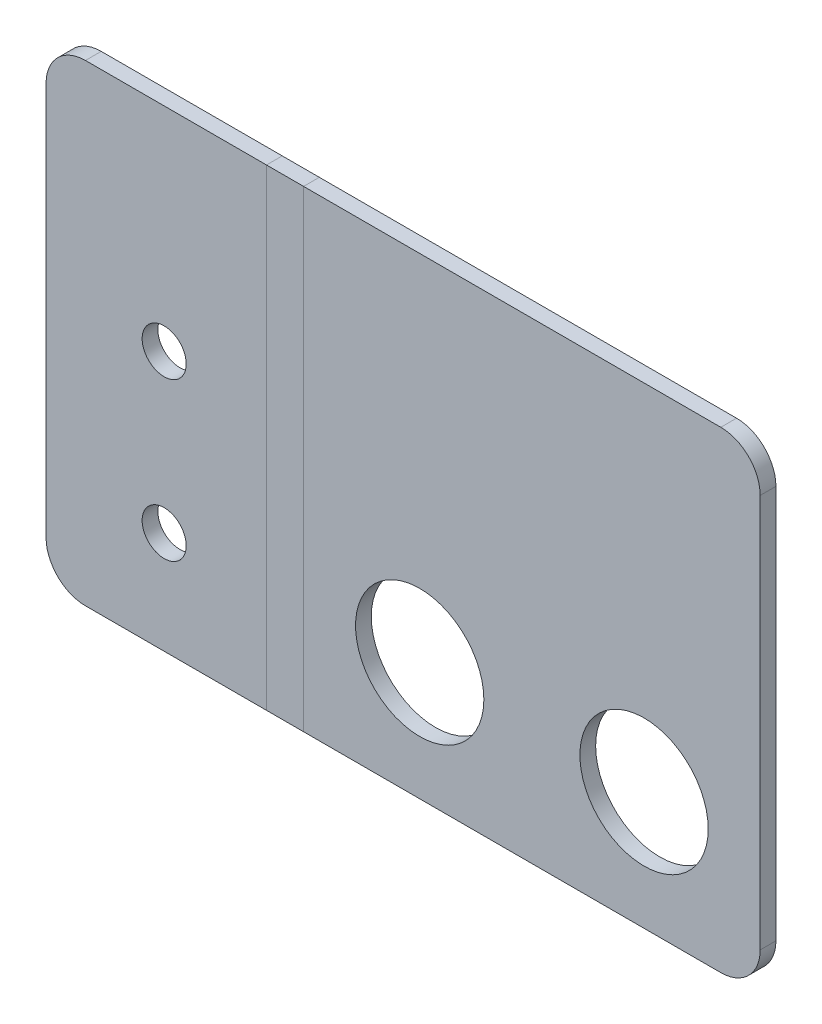
ISO-10303-21;
HEADER;
FILE_DESCRIPTION(('STEP AP214'),'2;1');
FILE_NAME('part.step','',(''),(''),'','','');
FILE_SCHEMA(('AUTOMOTIVE_DESIGN { 1 0 10303 214 1 1 1 1 }'));
ENDSEC;
DATA;
#1=APPLICATION_CONTEXT('core data for automotive mechanical design processes');
#2=APPLICATION_PROTOCOL_DEFINITION('international standard','automotive_design',2000,#1);
#3=PRODUCT_CONTEXT('',#1,'mechanical');
#4=PRODUCT('Part','Part','',(#3));
#5=PRODUCT_RELATED_PRODUCT_CATEGORY('part','',(#4));
#6=PRODUCT_DEFINITION_FORMATION('','',#4);
#7=PRODUCT_DEFINITION_CONTEXT('part definition',#1,'design');
#8=PRODUCT_DEFINITION('design','',#6,#7);
#9=PRODUCT_DEFINITION_SHAPE('','',#8);
#10=(LENGTH_UNIT() NAMED_UNIT(*) SI_UNIT(.MILLI.,.METRE.));
#11=(NAMED_UNIT(*) PLANE_ANGLE_UNIT() SI_UNIT($,.RADIAN.));
#12=(NAMED_UNIT(*) SI_UNIT($,.STERADIAN.) SOLID_ANGLE_UNIT());
#13=UNCERTAINTY_MEASURE_WITH_UNIT(LENGTH_MEASURE(1.E-05),#10,'distance_accuracy_value','');
#14=(GEOMETRIC_REPRESENTATION_CONTEXT(3) GLOBAL_UNCERTAINTY_ASSIGNED_CONTEXT((#13)) GLOBAL_UNIT_ASSIGNED_CONTEXT((#10,
#11,#12)) REPRESENTATION_CONTEXT('',''));
#15=CARTESIAN_POINT('',(0.,0.,0.));
#16=DIRECTION('',(0.,0.,1.));
#17=DIRECTION('',(1.,0.,0.));
#18=AXIS2_PLACEMENT_3D('',#15,#16,#17);
#19=CARTESIAN_POINT('',(75.7123889803847,-30.,2.00000000000041));
#20=DIRECTION('',(0.,1.,0.));
#21=DIRECTION('',(-1.,0.,0.));
#22=AXIS2_PLACEMENT_3D('',#19,#20,#21);
#23=PLANE('',#22);
#24=DIRECTION('',(1.,0.,0.));
#25=VECTOR('',#24,1.);
#26=CARTESIAN_POINT('',(75.7123889803847,-30.,4.0766001685455E-13));
#27=LINE('',#26,#25);
#28=CARTESIAN_POINT('',(17.7123889803847,-30.,0.));
#29=VERTEX_POINT('',#28);
#30=CARTESIAN_POINT('',(70.7123889803847,-30.,3.72965547335014E-13));
#31=VERTEX_POINT('',#30);
#32=EDGE_CURVE('E56',#29,#31,#27,.T.);
#33=ORIENTED_EDGE('',*,*,#32,.T.);
#34=DIRECTION('',(0.,0.,-1.));
#35=VECTOR('',#34,1.);
#36=CARTESIAN_POINT('',(70.7123889803847,-30.,2.00000000000037));
#37=LINE('',#36,#35);
#38=CARTESIAN_POINT('',(70.7123889803847,-30.,2.00000000000037));
#39=VERTEX_POINT('',#38);
#40=EDGE_CURVE('E252',#31,#39,#37,.F.);
#41=ORIENTED_EDGE('',*,*,#40,.T.);
#42=DIRECTION('',(1.,0.,0.));
#43=VECTOR('',#42,1.);
#44=CARTESIAN_POINT('',(75.7123889803847,-30.,2.00000000000041));
#45=LINE('',#44,#43);
#46=CARTESIAN_POINT('',(17.7123889803847,-30.,2.));
#47=VERTEX_POINT('',#46);
#48=EDGE_CURVE('E224',#47,#39,#45,.T.);
#49=ORIENTED_EDGE('',*,*,#48,.F.);
#50=DIRECTION('',(0.,0.,1.));
#51=VECTOR('',#50,1.);
#52=CARTESIAN_POINT('',(17.7123889803847,-30.,0.));
#53=LINE('',#52,#51);
#54=EDGE_CURVE('E11',#29,#47,#53,.T.);
#55=ORIENTED_EDGE('',*,*,#54,.F.);
#56=EDGE_LOOP('',(#33,#41,#49,#55));
#57=FACE_BOUND('',#56,.T.);
#58=ADVANCED_FACE('F41',(#57),#23,.F.);
#59=CARTESIAN_POINT('',(15.7123889803847,30.,1.99999999999999));
#60=DIRECTION('',(0.,-1.,0.));
#61=DIRECTION('',(1.,0.,0.));
#62=AXIS2_PLACEMENT_3D('',#59,#60,#61);
#63=PLANE('',#62);
#64=DIRECTION('',(-1.,0.,0.));
#65=VECTOR('',#64,1.);
#66=CARTESIAN_POINT('',(15.7123889803847,30.,1.99999999999999));
#67=LINE('',#66,#65);
#68=CARTESIAN_POINT('',(70.7123889803847,30.,2.00000000000037));
#69=VERTEX_POINT('',#68);
#70=CARTESIAN_POINT('',(17.7123889803847,30.,2.));
#71=VERTEX_POINT('',#70);
#72=EDGE_CURVE('E230',#69,#71,#67,.T.);
#73=ORIENTED_EDGE('',*,*,#72,.F.);
#74=DIRECTION('',(0.,0.,-1.));
#75=VECTOR('',#74,1.);
#76=CARTESIAN_POINT('',(70.7123889803847,30.,2.00000000000037));
#77=LINE('',#76,#75);
#78=CARTESIAN_POINT('',(70.7123889803847,30.,3.72965547335014E-13));
#79=VERTEX_POINT('',#78);
#80=EDGE_CURVE('E258',#69,#79,#77,.T.);
#81=ORIENTED_EDGE('',*,*,#80,.T.);
#82=DIRECTION('',(-1.,0.,0.));
#83=VECTOR('',#82,1.);
#84=CARTESIAN_POINT('',(15.7123889803847,30.,0.));
#85=LINE('',#84,#83);
#86=CARTESIAN_POINT('',(17.7123889803847,30.,0.));
#87=VERTEX_POINT('',#86);
#88=EDGE_CURVE('E64',#79,#87,#85,.T.);
#89=ORIENTED_EDGE('',*,*,#88,.T.);
#90=DIRECTION('',(0.,0.,1.));
#91=VECTOR('',#90,1.);
#92=CARTESIAN_POINT('',(17.7123889803847,30.,0.));
#93=LINE('',#92,#91);
#94=EDGE_CURVE('E261',#87,#71,#93,.T.);
#95=ORIENTED_EDGE('',*,*,#94,.T.);
#96=EDGE_LOOP('',(#73,#81,#89,#95));
#97=FACE_BOUND('',#96,.T.);
#98=ADVANCED_FACE('F299',(#97),#63,.F.);
#99=CARTESIAN_POINT('',(15.7123889803847,0.,1.99999999999999));
#100=DIRECTION('',(0.,0.,-1.));
#101=DIRECTION('',(-1.,0.,0.));
#102=AXIS2_PLACEMENT_3D('',#99,#100,#101);
#103=PLANE('',#102);
#104=CARTESIAN_POINT('',(32.4623889803847,-15.,2.0000000000001));
#105=DIRECTION('',(0.,0.,1.));
#106=DIRECTION('',(1.,0.,0.));
#107=AXIS2_PLACEMENT_3D('',#104,#105,#106);
#108=CIRCLE('',#107,8.15);
#109=CARTESIAN_POINT('',(40.6123889803847,-15.,2.00000000000016));
#110=VERTEX_POINT('',#109);
#111=EDGE_CURVE('E218',#110,#110,#108,.T.);
#112=ORIENTED_EDGE('',*,*,#111,.F.);
#113=EDGE_LOOP('',(#112));
#114=FACE_BOUND('',#113,.T.);
#115=CARTESIAN_POINT('',(60.9623889803847,-15.,2.00000000000031));
#116=DIRECTION('',(0.,0.,1.));
#117=DIRECTION('',(1.,0.,0.));
#118=AXIS2_PLACEMENT_3D('',#115,#116,#117);
#119=CIRCLE('',#118,8.15);
#120=CARTESIAN_POINT('',(69.1123889803847,-15.,2.00000000000036));
#121=VERTEX_POINT('',#120);
#122=EDGE_CURVE('E182',#121,#121,#119,.T.);
#123=ORIENTED_EDGE('',*,*,#122,.F.);
#124=EDGE_LOOP('',(#123));
#125=FACE_BOUND('',#124,.T.);
#126=ORIENTED_EDGE('',*,*,#48,.T.);
#127=CARTESIAN_POINT('',(70.7123889803847,-25.,2.00000000000037));
#128=DIRECTION('',(0.,0.,-1.));
#129=DIRECTION('',(-1.,0.,0.));
#130=AXIS2_PLACEMENT_3D('',#127,#128,#129);
#131=CIRCLE('',#130,5.);
#132=CARTESIAN_POINT('',(75.7123889803847,-25.,2.00000000000041));
#133=VERTEX_POINT('',#132);
#134=EDGE_CURVE('E256',#39,#133,#131,.F.);
#135=ORIENTED_EDGE('',*,*,#134,.T.);
#136=DIRECTION('',(0.,1.,0.));
#137=VECTOR('',#136,1.);
#138=CARTESIAN_POINT('',(75.7123889803847,30.,2.00000000000041));
#139=LINE('',#138,#137);
#140=CARTESIAN_POINT('',(75.7123889803847,25.,2.00000000000041));
#141=VERTEX_POINT('',#140);
#142=EDGE_CURVE('E227',#133,#141,#139,.T.);
#143=ORIENTED_EDGE('',*,*,#142,.T.);
#144=CARTESIAN_POINT('',(70.7123889803847,25.,2.00000000000037));
#145=DIRECTION('',(0.,0.,-1.));
#146=DIRECTION('',(-1.,0.,0.));
#147=AXIS2_PLACEMENT_3D('',#144,#145,#146);
#148=CIRCLE('',#147,5.);
#149=EDGE_CURVE('E254',#141,#69,#148,.F.);
#150=ORIENTED_EDGE('',*,*,#149,.T.);
#151=ORIENTED_EDGE('',*,*,#72,.T.);
#152=DIRECTION('',(0.,1.,0.));
#153=VECTOR('',#152,1.);
#154=CARTESIAN_POINT('',(17.7123889803847,0.,2.));
#155=LINE('',#154,#153);
#156=EDGE_CURVE('E170',#47,#71,#155,.T.);
#157=ORIENTED_EDGE('',*,*,#156,.F.);
#158=EDGE_LOOP('',(#126,#135,#143,#150,#151,#157));
#159=FACE_BOUND('',#158,.T.);
#160=ADVANCED_FACE('F305',(#114,#125,#159),#103,.F.);
#161=CARTESIAN_POINT('',(15.7123889803847,0.,0.));
#162=DIRECTION('',(0.,0.,-1.));
#163=DIRECTION('',(-1.,0.,0.));
#164=AXIS2_PLACEMENT_3D('',#161,#162,#163);
#165=PLANE('',#164);
#166=CARTESIAN_POINT('',(32.4623889803847,-15.,1.05818132034585E-13));
#167=DIRECTION('',(0.,0.,-1.));
#168=DIRECTION('',(-1.,0.,0.));
#169=AXIS2_PLACEMENT_3D('',#166,#167,#168);
#170=CIRCLE('',#169,8.15);
#171=CARTESIAN_POINT('',(24.3123889803847,-15.,0.));
#172=VERTEX_POINT('',#171);
#173=EDGE_CURVE('E236',#172,#172,#170,.T.);
#174=ORIENTED_EDGE('',*,*,#173,.F.);
#175=EDGE_LOOP('',(#174));
#176=FACE_BOUND('',#175,.T.);
#177=CARTESIAN_POINT('',(60.9623889803847,-15.,3.05311331771918E-13));
#178=DIRECTION('',(0.,0.,-1.));
#179=DIRECTION('',(-1.,0.,0.));
#180=AXIS2_PLACEMENT_3D('',#177,#178,#179);
#181=CIRCLE('',#180,8.15);
#182=CARTESIAN_POINT('',(52.8123889803847,-15.,2.48344132929771E-13));
#183=VERTEX_POINT('',#182);
#184=EDGE_CURVE('E221',#183,#183,#181,.T.);
#185=ORIENTED_EDGE('',*,*,#184,.F.);
#186=EDGE_LOOP('',(#185));
#187=FACE_BOUND('',#186,.T.);
#188=DIRECTION('',(0.,1.,0.));
#189=VECTOR('',#188,1.);
#190=CARTESIAN_POINT('',(75.7123889803847,30.,4.0766001685455E-13));
#191=LINE('',#190,#189);
#192=CARTESIAN_POINT('',(75.7123889803847,-25.,4.0766001685455E-13));
#193=VERTEX_POINT('',#192);
#194=CARTESIAN_POINT('',(75.7123889803847,25.,4.0766001685455E-13));
#195=VERTEX_POINT('',#194);
#196=EDGE_CURVE('E235',#193,#195,#191,.T.);
#197=ORIENTED_EDGE('',*,*,#196,.F.);
#198=CARTESIAN_POINT('',(70.7123889803847,-25.,3.72965547335014E-13));
#199=DIRECTION('',(0.,0.,-1.));
#200=DIRECTION('',(-1.,0.,0.));
#201=AXIS2_PLACEMENT_3D('',#198,#199,#200);
#202=CIRCLE('',#201,5.);
#203=EDGE_CURVE('E250',#193,#31,#202,.T.);
#204=ORIENTED_EDGE('',*,*,#203,.T.);
#205=ORIENTED_EDGE('',*,*,#32,.F.);
#206=DIRECTION('',(0.,-1.,0.));
#207=VECTOR('',#206,1.);
#208=CARTESIAN_POINT('',(17.7123889803847,30.,0.));
#209=LINE('',#208,#207);
#210=EDGE_CURVE('E49',#87,#29,#209,.T.);
#211=ORIENTED_EDGE('',*,*,#210,.F.);
#212=ORIENTED_EDGE('',*,*,#88,.F.);
#213=CARTESIAN_POINT('',(70.7123889803847,25.,3.72965547335014E-13));
#214=DIRECTION('',(0.,0.,-1.));
#215=DIRECTION('',(-1.,0.,0.));
#216=AXIS2_PLACEMENT_3D('',#213,#214,#215);
#217=CIRCLE('',#216,5.);
#218=EDGE_CURVE('E248',#79,#195,#217,.T.);
#219=ORIENTED_EDGE('',*,*,#218,.T.);
#220=EDGE_LOOP('',(#197,#204,#205,#211,#212,#219));
#221=FACE_BOUND('',#220,.T.);
#222=ADVANCED_FACE('F330',(#176,#187,#221),#165,.T.);
#223=CARTESIAN_POINT('',(75.7123889803847,30.,2.00000000000041));
#224=DIRECTION('',(-1.,0.,0.));
#225=DIRECTION('',(0.,0.,1.));
#226=AXIS2_PLACEMENT_3D('',#223,#224,#225);
#227=PLANE('',#226);
#228=ORIENTED_EDGE('',*,*,#142,.F.);
#229=DIRECTION('',(0.,0.,-1.));
#230=VECTOR('',#229,1.);
#231=CARTESIAN_POINT('',(75.7123889803847,-25.,2.00000000000041));
#232=LINE('',#231,#230);
#233=EDGE_CURVE('E245',#133,#193,#232,.T.);
#234=ORIENTED_EDGE('',*,*,#233,.T.);
#235=ORIENTED_EDGE('',*,*,#196,.T.);
#236=DIRECTION('',(0.,0.,-1.));
#237=VECTOR('',#236,1.);
#238=CARTESIAN_POINT('',(75.7123889803847,25.,2.00000000000041));
#239=LINE('',#238,#237);
#240=EDGE_CURVE('E233',#195,#141,#239,.F.);
#241=ORIENTED_EDGE('',*,*,#240,.T.);
#242=EDGE_LOOP('',(#228,#234,#235,#241));
#243=FACE_BOUND('',#242,.T.);
#244=ADVANCED_FACE('F308',(#243),#227,.F.);
#245=CARTESIAN_POINT('',(60.9623889803849,-15.,-29.9999999999999));
#246=DIRECTION('',(0.,0.,1.));
#247=DIRECTION('',(1.,0.,0.));
#248=AXIS2_PLACEMENT_3D('',#245,#246,#247);
#249=CYLINDRICAL_SURFACE('',#248,8.15);
#250=ORIENTED_EDGE('',*,*,#184,.T.);
#251=EDGE_LOOP('',(#250));
#252=FACE_BOUND('',#251,.T.);
#253=ORIENTED_EDGE('',*,*,#122,.T.);
#254=EDGE_LOOP('',(#253));
#255=FACE_BOUND('',#254,.T.);
#256=ADVANCED_FACE('F315',(#252,#255),#249,.F.);
#257=CARTESIAN_POINT('',(32.4623889803849,-15.,-30.0000000000001));
#258=DIRECTION('',(0.,0.,1.));
#259=DIRECTION('',(1.,0.,0.));
#260=AXIS2_PLACEMENT_3D('',#257,#258,#259);
#261=CYLINDRICAL_SURFACE('',#260,8.15);
#262=ORIENTED_EDGE('',*,*,#173,.T.);
#263=EDGE_LOOP('',(#262));
#264=FACE_BOUND('',#263,.T.);
#265=ORIENTED_EDGE('',*,*,#111,.T.);
#266=EDGE_LOOP('',(#265));
#267=FACE_BOUND('',#266,.T.);
#268=ADVANCED_FACE('F310',(#264,#267),#261,.F.);
#269=CARTESIAN_POINT('',(70.7123889803847,-25.,2.00000000000037));
#270=DIRECTION('',(0.,0.,-1.));
#271=DIRECTION('',(-1.,0.,0.));
#272=AXIS2_PLACEMENT_3D('',#269,#270,#271);
#273=CYLINDRICAL_SURFACE('',#272,5.);
#274=ORIENTED_EDGE('',*,*,#134,.F.);
#275=ORIENTED_EDGE('',*,*,#40,.F.);
#276=ORIENTED_EDGE('',*,*,#203,.F.);
#277=ORIENTED_EDGE('',*,*,#233,.F.);
#278=EDGE_LOOP('',(#274,#275,#276,#277));
#279=FACE_BOUND('',#278,.T.);
#280=ADVANCED_FACE('F295',(#279),#273,.T.);
#281=CARTESIAN_POINT('',(70.7123889803847,25.,2.00000000000037));
#282=DIRECTION('',(0.,0.,-1.));
#283=DIRECTION('',(-1.,0.,0.));
#284=AXIS2_PLACEMENT_3D('',#281,#282,#283);
#285=CYLINDRICAL_SURFACE('',#284,5.);
#286=ORIENTED_EDGE('',*,*,#149,.F.);
#287=ORIENTED_EDGE('',*,*,#240,.F.);
#288=ORIENTED_EDGE('',*,*,#218,.F.);
#289=ORIENTED_EDGE('',*,*,#80,.F.);
#290=EDGE_LOOP('',(#286,#287,#288,#289));
#291=FACE_BOUND('',#290,.T.);
#292=ADVANCED_FACE('F43',(#291),#285,.T.);
#293=CARTESIAN_POINT('',(-10.,-25.,2.));
#294=DIRECTION('',(0.,0.,1.));
#295=DIRECTION('',(1.,0.,0.));
#296=AXIS2_PLACEMENT_3D('',#293,#294,#295);
#297=CYLINDRICAL_SURFACE('',#296,5.);
#298=CARTESIAN_POINT('',(-10.,-25.,0.));
#299=DIRECTION('',(0.,0.,-1.));
#300=DIRECTION('',(-1.,0.,0.));
#301=AXIS2_PLACEMENT_3D('',#298,#299,#300);
#302=CIRCLE('',#301,5.);
#303=CARTESIAN_POINT('',(-10.,-30.,0.));
#304=VERTEX_POINT('',#303);
#305=CARTESIAN_POINT('',(-15.,-25.,0.));
#306=VERTEX_POINT('',#305);
#307=EDGE_CURVE('E187',#304,#306,#302,.T.);
#308=ORIENTED_EDGE('',*,*,#307,.F.);
#309=DIRECTION('',(0.,0.,-1.));
#310=VECTOR('',#309,1.);
#311=CARTESIAN_POINT('',(-10.,-30.,2.));
#312=LINE('',#311,#310);
#313=CARTESIAN_POINT('',(-10.,-30.,2.));
#314=VERTEX_POINT('',#313);
#315=EDGE_CURVE('E185',#314,#304,#312,.T.);
#316=ORIENTED_EDGE('',*,*,#315,.F.);
#317=CARTESIAN_POINT('',(-10.,-25.,2.));
#318=DIRECTION('',(0.,0.,-1.));
#319=DIRECTION('',(-1.,0.,0.));
#320=AXIS2_PLACEMENT_3D('',#317,#318,#319);
#321=CIRCLE('',#320,5.);
#322=CARTESIAN_POINT('',(-15.,-25.,2.));
#323=VERTEX_POINT('',#322);
#324=EDGE_CURVE('E200',#323,#314,#321,.F.);
#325=ORIENTED_EDGE('',*,*,#324,.F.);
#326=DIRECTION('',(0.,0.,-1.));
#327=VECTOR('',#326,1.);
#328=CARTESIAN_POINT('',(-15.,-25.,2.));
#329=LINE('',#328,#327);
#330=EDGE_CURVE('E211',#306,#323,#329,.F.);
#331=ORIENTED_EDGE('',*,*,#330,.F.);
#332=EDGE_LOOP('',(#308,#316,#325,#331));
#333=FACE_BOUND('',#332,.T.);
#334=ADVANCED_FACE('F287',(#333),#297,.T.);
#335=CARTESIAN_POINT('',(-15.,-30.,2.));
#336=DIRECTION('',(1.,0.,0.));
#337=DIRECTION('',(0.,-1.,0.));
#338=AXIS2_PLACEMENT_3D('',#335,#336,#337);
#339=PLANE('',#338);
#340=DIRECTION('',(0.,-1.,0.));
#341=VECTOR('',#340,1.);
#342=CARTESIAN_POINT('',(-15.,-30.,2.));
#343=LINE('',#342,#341);
#344=CARTESIAN_POINT('',(-15.,25.,2.));
#345=VERTEX_POINT('',#344);
#346=EDGE_CURVE('E202',#345,#323,#343,.T.);
#347=ORIENTED_EDGE('',*,*,#346,.F.);
#348=DIRECTION('',(0.,0.,-1.));
#349=VECTOR('',#348,1.);
#350=CARTESIAN_POINT('',(-15.,25.,2.));
#351=LINE('',#350,#349);
#352=CARTESIAN_POINT('',(-15.,25.,0.));
#353=VERTEX_POINT('',#352);
#354=EDGE_CURVE('E165',#345,#353,#351,.T.);
#355=ORIENTED_EDGE('',*,*,#354,.T.);
#356=DIRECTION('',(0.,1.,0.));
#357=VECTOR('',#356,1.);
#358=CARTESIAN_POINT('',(-15.,0.,0.));
#359=LINE('',#358,#357);
#360=EDGE_CURVE('E214',#353,#306,#359,.F.);
#361=ORIENTED_EDGE('',*,*,#360,.T.);
#362=ORIENTED_EDGE('',*,*,#330,.T.);
#363=EDGE_LOOP('',(#347,#355,#361,#362));
#364=FACE_BOUND('',#363,.T.);
#365=ADVANCED_FACE('F284',(#364),#339,.F.);
#366=CARTESIAN_POINT('',(-10.,25.,2.));
#367=DIRECTION('',(0.,0.,1.));
#368=DIRECTION('',(1.,0.,0.));
#369=AXIS2_PLACEMENT_3D('',#366,#367,#368);
#370=CYLINDRICAL_SURFACE('',#369,5.);
#371=CARTESIAN_POINT('',(-10.,25.,0.));
#372=DIRECTION('',(0.,0.,-1.));
#373=DIRECTION('',(-1.,0.,0.));
#374=AXIS2_PLACEMENT_3D('',#371,#372,#373);
#375=CIRCLE('',#374,5.);
#376=CARTESIAN_POINT('',(-10.,30.,0.));
#377=VERTEX_POINT('',#376);
#378=EDGE_CURVE('E189',#353,#377,#375,.T.);
#379=ORIENTED_EDGE('',*,*,#378,.F.);
#380=ORIENTED_EDGE('',*,*,#354,.F.);
#381=CARTESIAN_POINT('',(-10.,25.,2.));
#382=DIRECTION('',(0.,0.,-1.));
#383=DIRECTION('',(-1.,0.,0.));
#384=AXIS2_PLACEMENT_3D('',#381,#382,#383);
#385=CIRCLE('',#384,5.);
#386=CARTESIAN_POINT('',(-10.,30.,2.));
#387=VERTEX_POINT('',#386);
#388=EDGE_CURVE('E142',#387,#345,#385,.F.);
#389=ORIENTED_EDGE('',*,*,#388,.F.);
#390=DIRECTION('',(0.,0.,-1.));
#391=VECTOR('',#390,1.);
#392=CARTESIAN_POINT('',(-10.,30.,2.));
#393=LINE('',#392,#391);
#394=EDGE_CURVE('E140',#377,#387,#393,.F.);
#395=ORIENTED_EDGE('',*,*,#394,.F.);
#396=EDGE_LOOP('',(#379,#380,#389,#395));
#397=FACE_BOUND('',#396,.T.);
#398=ADVANCED_FACE('F280',(#397),#370,.T.);
#399=CARTESIAN_POINT('',(0.,2.99999999999999,2.));
#400=DIRECTION('',(0.,0.,-1.));
#401=DIRECTION('',(-1.,0.,0.));
#402=AXIS2_PLACEMENT_3D('',#399,#400,#401);
#403=CYLINDRICAL_SURFACE('',#402,2.8);
#404=CARTESIAN_POINT('',(0.,2.99999999999999,2.));
#405=DIRECTION('',(0.,0.,1.));
#406=DIRECTION('',(1.,0.,0.));
#407=AXIS2_PLACEMENT_3D('',#404,#405,#406);
#408=CIRCLE('',#407,2.8);
#409=CARTESIAN_POINT('',(2.79999999999999,2.99999999999999,2.));
#410=VERTEX_POINT('',#409);
#411=EDGE_CURVE('E208',#410,#410,#408,.T.);
#412=ORIENTED_EDGE('',*,*,#411,.T.);
#413=EDGE_LOOP('',(#412));
#414=FACE_BOUND('',#413,.T.);
#415=CARTESIAN_POINT('',(0.,2.99999999999999,0.));
#416=DIRECTION('',(0.,0.,1.));
#417=DIRECTION('',(1.,0.,0.));
#418=AXIS2_PLACEMENT_3D('',#415,#416,#417);
#419=CIRCLE('',#418,2.8);
#420=CARTESIAN_POINT('',(2.79999999999999,2.99999999999999,0.));
#421=VERTEX_POINT('',#420);
#422=EDGE_CURVE('E194',#421,#421,#419,.T.);
#423=ORIENTED_EDGE('',*,*,#422,.F.);
#424=EDGE_LOOP('',(#423));
#425=FACE_BOUND('',#424,.T.);
#426=ADVANCED_FACE('F359',(#414,#425),#403,.F.);
#427=CARTESIAN_POINT('',(0.,-17.,2.));
#428=DIRECTION('',(0.,0.,-1.));
#429=DIRECTION('',(-1.,0.,0.));
#430=AXIS2_PLACEMENT_3D('',#427,#428,#429);
#431=CYLINDRICAL_SURFACE('',#430,2.8);
#432=CARTESIAN_POINT('',(0.,-17.,2.));
#433=DIRECTION('',(0.,0.,1.));
#434=DIRECTION('',(1.,0.,0.));
#435=AXIS2_PLACEMENT_3D('',#432,#433,#434);
#436=CIRCLE('',#435,2.8);
#437=CARTESIAN_POINT('',(2.8,-17.,2.));
#438=VERTEX_POINT('',#437);
#439=EDGE_CURVE('E143',#438,#438,#436,.T.);
#440=ORIENTED_EDGE('',*,*,#439,.T.);
#441=EDGE_LOOP('',(#440));
#442=FACE_BOUND('',#441,.T.);
#443=CARTESIAN_POINT('',(0.,-17.,0.));
#444=DIRECTION('',(0.,0.,1.));
#445=DIRECTION('',(1.,0.,0.));
#446=AXIS2_PLACEMENT_3D('',#443,#444,#445);
#447=CIRCLE('',#446,2.8);
#448=CARTESIAN_POINT('',(2.8,-17.,0.));
#449=VERTEX_POINT('',#448);
#450=EDGE_CURVE('E191',#449,#449,#447,.T.);
#451=ORIENTED_EDGE('',*,*,#450,.F.);
#452=EDGE_LOOP('',(#451));
#453=FACE_BOUND('',#452,.T.);
#454=ADVANCED_FACE('F355',(#442,#453),#431,.F.);
#455=CARTESIAN_POINT('',(0.,0.,2.));
#456=DIRECTION('',(0.,0.,-1.));
#457=DIRECTION('',(-1.,0.,0.));
#458=AXIS2_PLACEMENT_3D('',#455,#456,#457);
#459=PLANE('',#458);
#460=ORIENTED_EDGE('',*,*,#439,.F.);
#461=EDGE_LOOP('',(#460));
#462=FACE_BOUND('',#461,.T.);
#463=ORIENTED_EDGE('',*,*,#411,.F.);
#464=EDGE_LOOP('',(#463));
#465=FACE_BOUND('',#464,.T.);
#466=DIRECTION('',(-1.,0.,0.));
#467=VECTOR('',#466,1.);
#468=CARTESIAN_POINT('',(-15.,30.,2.));
#469=LINE('',#468,#467);
#470=CARTESIAN_POINT('',(13.,30.,2.));
#471=VERTEX_POINT('',#470);
#472=EDGE_CURVE('E132',#471,#387,#469,.T.);
#473=ORIENTED_EDGE('',*,*,#472,.T.);
#474=ORIENTED_EDGE('',*,*,#388,.T.);
#475=ORIENTED_EDGE('',*,*,#346,.T.);
#476=ORIENTED_EDGE('',*,*,#324,.T.);
#477=DIRECTION('',(1.,0.,0.));
#478=VECTOR('',#477,1.);
#479=CARTESIAN_POINT('',(-15.,-30.,2.));
#480=LINE('',#479,#478);
#481=CARTESIAN_POINT('',(13.,-30.,2.));
#482=VERTEX_POINT('',#481);
#483=EDGE_CURVE('E149',#314,#482,#480,.T.);
#484=ORIENTED_EDGE('',*,*,#483,.T.);
#485=DIRECTION('',(0.,1.,0.));
#486=VECTOR('',#485,1.);
#487=CARTESIAN_POINT('',(13.,-30.,2.));
#488=LINE('',#487,#486);
#489=EDGE_CURVE('E146',#482,#471,#488,.T.);
#490=ORIENTED_EDGE('',*,*,#489,.T.);
#491=EDGE_LOOP('',(#473,#474,#475,#476,#484,#490));
#492=FACE_BOUND('',#491,.T.);
#493=ADVANCED_FACE('F147',(#462,#465,#492),#459,.F.);
#494=CARTESIAN_POINT('',(-15.,30.,2.));
#495=DIRECTION('',(0.,-1.,0.));
#496=DIRECTION('',(-1.,0.,0.));
#497=AXIS2_PLACEMENT_3D('',#494,#495,#496);
#498=PLANE('',#497);
#499=DIRECTION('',(-1.,0.,0.));
#500=VECTOR('',#499,1.);
#501=CARTESIAN_POINT('',(0.,30.,0.));
#502=LINE('',#501,#500);
#503=CARTESIAN_POINT('',(13.,30.,0.));
#504=VERTEX_POINT('',#503);
#505=EDGE_CURVE('E155',#504,#377,#502,.T.);
#506=ORIENTED_EDGE('',*,*,#505,.T.);
#507=ORIENTED_EDGE('',*,*,#394,.T.);
#508=ORIENTED_EDGE('',*,*,#472,.F.);
#509=DIRECTION('',(0.,0.,1.));
#510=VECTOR('',#509,1.);
#511=CARTESIAN_POINT('',(13.,30.,0.));
#512=LINE('',#511,#510);
#513=EDGE_CURVE('E137',#504,#471,#512,.T.);
#514=ORIENTED_EDGE('',*,*,#513,.F.);
#515=EDGE_LOOP('',(#506,#507,#508,#514));
#516=FACE_BOUND('',#515,.T.);
#517=ADVANCED_FACE('F135',(#516),#498,.F.);
#518=CARTESIAN_POINT('',(0.,0.,0.));
#519=DIRECTION('',(0.,0.,-1.));
#520=DIRECTION('',(-1.,0.,0.));
#521=AXIS2_PLACEMENT_3D('',#518,#519,#520);
#522=PLANE('',#521);
#523=ORIENTED_EDGE('',*,*,#422,.T.);
#524=EDGE_LOOP('',(#523));
#525=FACE_BOUND('',#524,.T.);
#526=ORIENTED_EDGE('',*,*,#450,.T.);
#527=EDGE_LOOP('',(#526));
#528=FACE_BOUND('',#527,.T.);
#529=ORIENTED_EDGE('',*,*,#360,.F.);
#530=ORIENTED_EDGE('',*,*,#378,.T.);
#531=ORIENTED_EDGE('',*,*,#505,.F.);
#532=DIRECTION('',(0.,1.,0.));
#533=VECTOR('',#532,1.);
#534=CARTESIAN_POINT('',(13.,-30.,0.));
#535=LINE('',#534,#533);
#536=CARTESIAN_POINT('',(13.,-30.,0.));
#537=VERTEX_POINT('',#536);
#538=EDGE_CURVE('E166',#537,#504,#535,.T.);
#539=ORIENTED_EDGE('',*,*,#538,.F.);
#540=DIRECTION('',(-1.,0.,0.));
#541=VECTOR('',#540,1.);
#542=CARTESIAN_POINT('',(0.,-30.,0.));
#543=LINE('',#542,#541);
#544=EDGE_CURVE('E183',#304,#537,#543,.F.);
#545=ORIENTED_EDGE('',*,*,#544,.F.);
#546=ORIENTED_EDGE('',*,*,#307,.T.);
#547=EDGE_LOOP('',(#529,#530,#531,#539,#545,#546));
#548=FACE_BOUND('',#547,.T.);
#549=ADVANCED_FACE('F277',(#525,#528,#548),#522,.T.);
#550=CARTESIAN_POINT('',(-15.,-30.,2.));
#551=DIRECTION('',(0.,1.,0.));
#552=DIRECTION('',(1.,0.,0.));
#553=AXIS2_PLACEMENT_3D('',#550,#551,#552);
#554=PLANE('',#553);
#555=ORIENTED_EDGE('',*,*,#483,.F.);
#556=ORIENTED_EDGE('',*,*,#315,.T.);
#557=ORIENTED_EDGE('',*,*,#544,.T.);
#558=DIRECTION('',(0.,0.,1.));
#559=VECTOR('',#558,1.);
#560=CARTESIAN_POINT('',(13.,-30.,0.));
#561=LINE('',#560,#559);
#562=EDGE_CURVE('E180',#537,#482,#561,.T.);
#563=ORIENTED_EDGE('',*,*,#562,.T.);
#564=EDGE_LOOP('',(#555,#556,#557,#563));
#565=FACE_BOUND('',#564,.T.);
#566=ADVANCED_FACE('F270',(#565),#554,.F.);
#567=CARTESIAN_POINT('',(17.7123889803847,-30.,2.));
#568=DIRECTION('',(0.,-1.,0.));
#569=DIRECTION('',(1.,0.,0.));
#570=AXIS2_PLACEMENT_3D('',#567,#568,#569);
#571=PLANE('',#570);
#572=ORIENTED_EDGE('',*,*,#562,.F.);
#573=DIRECTION('',(1.,0.,0.));
#574=VECTOR('',#573,1.);
#575=CARTESIAN_POINT('',(15.3561944901924,-30.,0.));
#576=LINE('',#575,#574);
#577=EDGE_CURVE('E176',#537,#29,#576,.T.);
#578=ORIENTED_EDGE('',*,*,#577,.T.);
#579=ORIENTED_EDGE('',*,*,#54,.T.);
#580=DIRECTION('',(1.,0.,0.));
#581=VECTOR('',#580,1.);
#582=CARTESIAN_POINT('',(17.7123889803847,-30.,2.));
#583=LINE('',#582,#581);
#584=EDGE_CURVE('E171',#482,#47,#583,.T.);
#585=ORIENTED_EDGE('',*,*,#584,.F.);
#586=EDGE_LOOP('',(#572,#578,#579,#585));
#587=FACE_BOUND('',#586,.T.);
#588=ADVANCED_FACE('F268',(#587),#571,.T.);
#589=CARTESIAN_POINT('',(13.,30.,2.));
#590=DIRECTION('',(0.,1.,0.));
#591=DIRECTION('',(-1.,0.,0.));
#592=AXIS2_PLACEMENT_3D('',#589,#590,#591);
#593=PLANE('',#592);
#594=DIRECTION('',(1.,0.,0.));
#595=VECTOR('',#594,1.);
#596=CARTESIAN_POINT('',(15.3561944901924,30.,0.));
#597=LINE('',#596,#595);
#598=EDGE_CURVE('E164',#87,#504,#597,.F.);
#599=ORIENTED_EDGE('',*,*,#598,.T.);
#600=ORIENTED_EDGE('',*,*,#513,.T.);
#601=DIRECTION('',(-1.,0.,0.));
#602=VECTOR('',#601,1.);
#603=CARTESIAN_POINT('',(13.,30.,2.));
#604=LINE('',#603,#602);
#605=EDGE_CURVE('E162',#71,#471,#604,.T.);
#606=ORIENTED_EDGE('',*,*,#605,.F.);
#607=ORIENTED_EDGE('',*,*,#94,.F.);
#608=EDGE_LOOP('',(#599,#600,#606,#607));
#609=FACE_BOUND('',#608,.T.);
#610=ADVANCED_FACE('F160',(#609),#593,.T.);
#611=CARTESIAN_POINT('',(15.3561944901924,0.,2.));
#612=DIRECTION('',(0.,0.,1.));
#613=DIRECTION('',(1.,0.,0.));
#614=AXIS2_PLACEMENT_3D('',#611,#612,#613);
#615=PLANE('',#614);
#616=ORIENTED_EDGE('',*,*,#156,.T.);
#617=ORIENTED_EDGE('',*,*,#605,.T.);
#618=ORIENTED_EDGE('',*,*,#489,.F.);
#619=ORIENTED_EDGE('',*,*,#584,.T.);
#620=EDGE_LOOP('',(#616,#617,#618,#619));
#621=FACE_BOUND('',#620,.T.);
#622=ADVANCED_FACE('F169',(#621),#615,.T.);
#623=CARTESIAN_POINT('',(15.3561944901924,0.,0.));
#624=DIRECTION('',(0.,0.,1.));
#625=DIRECTION('',(1.,0.,0.));
#626=AXIS2_PLACEMENT_3D('',#623,#624,#625);
#627=PLANE('',#626);
#628=ORIENTED_EDGE('',*,*,#210,.T.);
#629=ORIENTED_EDGE('',*,*,#577,.F.);
#630=ORIENTED_EDGE('',*,*,#538,.T.);
#631=ORIENTED_EDGE('',*,*,#598,.F.);
#632=EDGE_LOOP('',(#628,#629,#630,#631));
#633=FACE_BOUND('',#632,.T.);
#634=ADVANCED_FACE('F265',(#633),#627,.F.);
#635=CLOSED_SHELL('',(#58,#98,#160,#222,#244,#256,#268,#280,#292,#334,#365,#398,#426,#454,#493,
#517,#549,#566,#588,#610,#622,#634));
#636=MANIFOLD_SOLID_BREP('B2',#635);
#637=ADVANCED_BREP_SHAPE_REPRESENTATION('',(#18,#636),#14);
#638=SHAPE_DEFINITION_REPRESENTATION(#9,#637);
ENDSEC;
END-ISO-10303-21;
